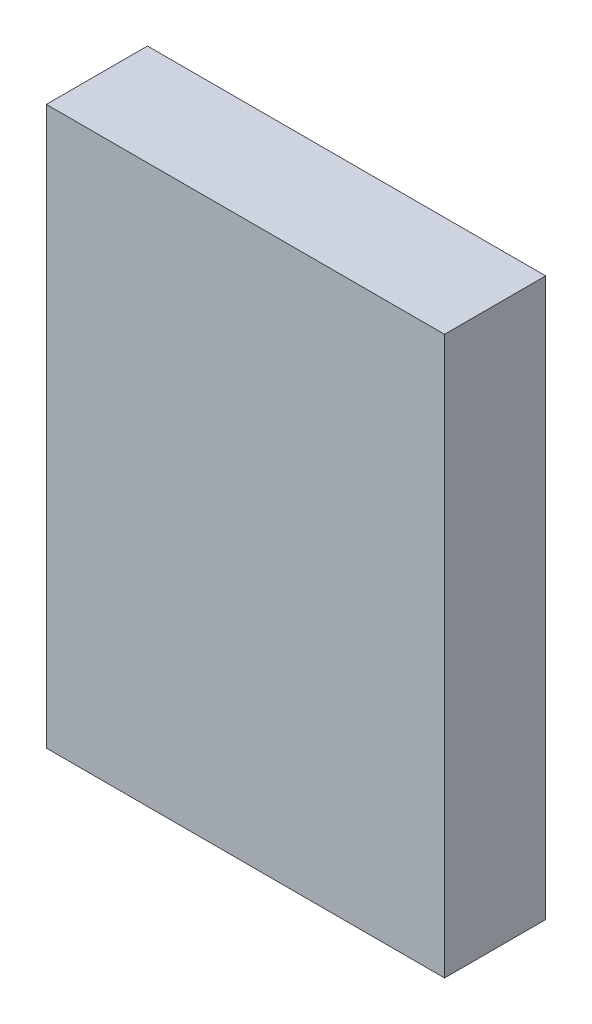
ISO-10303-21;
HEADER;
FILE_DESCRIPTION(('STEP AP214'),'2;1');
FILE_NAME('part.step','',(''),(''),'','','');
FILE_SCHEMA(('AUTOMOTIVE_DESIGN { 1 0 10303 214 1 1 1 1 }'));
ENDSEC;
DATA;
#1=APPLICATION_CONTEXT('core data for automotive mechanical design processes');
#2=APPLICATION_PROTOCOL_DEFINITION('international standard','automotive_design',2000,#1);
#3=PRODUCT_CONTEXT('',#1,'mechanical');
#4=PRODUCT('Part','Part','',(#3));
#5=PRODUCT_RELATED_PRODUCT_CATEGORY('part','',(#4));
#6=PRODUCT_DEFINITION_FORMATION('','',#4);
#7=PRODUCT_DEFINITION_CONTEXT('part definition',#1,'design');
#8=PRODUCT_DEFINITION('design','',#6,#7);
#9=PRODUCT_DEFINITION_SHAPE('','',#8);
#10=(LENGTH_UNIT() NAMED_UNIT(*) SI_UNIT(.MILLI.,.METRE.));
#11=(NAMED_UNIT(*) PLANE_ANGLE_UNIT() SI_UNIT($,.RADIAN.));
#12=(NAMED_UNIT(*) SI_UNIT($,.STERADIAN.) SOLID_ANGLE_UNIT());
#13=UNCERTAINTY_MEASURE_WITH_UNIT(LENGTH_MEASURE(1.E-05),#10,'distance_accuracy_value','');
#14=(GEOMETRIC_REPRESENTATION_CONTEXT(3) GLOBAL_UNCERTAINTY_ASSIGNED_CONTEXT((#13)) GLOBAL_UNIT_ASSIGNED_CONTEXT((#10,
#11,#12)) REPRESENTATION_CONTEXT('',''));
#15=CARTESIAN_POINT('',(0.,0.,0.));
#16=DIRECTION('',(0.,0.,1.));
#17=DIRECTION('',(1.,0.,0.));
#18=AXIS2_PLACEMENT_3D('',#15,#16,#17);
#19=CARTESIAN_POINT('',(-1.25000004,-1.74999904,0.635));
#20=DIRECTION('',(0.,0.,-1.));
#21=DIRECTION('',(-1.,0.,0.));
#22=AXIS2_PLACEMENT_3D('',#19,#20,#21);
#23=PLANE('',#22);
#24=DIRECTION('',(0.,1.,0.));
#25=VECTOR('',#24,1.);
#26=CARTESIAN_POINT('',(1.25000258,-1.75000158,0.635));
#27=LINE('',#26,#25);
#28=CARTESIAN_POINT('',(1.25000258,-1.75000158,0.635));
#29=VERTEX_POINT('',#28);
#30=CARTESIAN_POINT('',(1.25000258,1.75000031,0.635));
#31=VERTEX_POINT('',#30);
#32=EDGE_CURVE('E54',#29,#31,#27,.T.);
#33=ORIENTED_EDGE('',*,*,#32,.T.);
#34=DIRECTION('',(0.999999999999484,1.01599893403249E-06,0.));
#35=VECTOR('',#34,1.);
#36=CARTESIAN_POINT('',(1.25000258,1.75000158,0.635));
#37=LINE('',#36,#35);
#38=CARTESIAN_POINT('',(-1.25000004,1.74999904,0.635));
#39=VERTEX_POINT('',#38);
#40=EDGE_CURVE('E56',#31,#39,#37,.F.);
#41=ORIENTED_EDGE('',*,*,#40,.T.);
#42=DIRECTION('',(0.,1.,0.));
#43=VECTOR('',#42,1.);
#44=CARTESIAN_POINT('',(-1.25000004,1.74999904,0.635));
#45=LINE('',#44,#43);
#46=CARTESIAN_POINT('',(-1.25000004,-1.749999675,0.635));
#47=VERTEX_POINT('',#46);
#48=EDGE_CURVE('E19',#39,#47,#45,.F.);
#49=ORIENTED_EDGE('',*,*,#48,.T.);
#50=DIRECTION('',(-0.999999999999484,1.01599893403249E-06,0.));
#51=VECTOR('',#50,1.);
#52=CARTESIAN_POINT('',(-1.25000004,-1.74999904,0.635));
#53=LINE('',#52,#51);
#54=EDGE_CURVE('E79',#47,#29,#53,.F.);
#55=ORIENTED_EDGE('',*,*,#54,.T.);
#56=EDGE_LOOP('',(#33,#41,#49,#55));
#57=FACE_BOUND('',#56,.T.);
#58=ADVANCED_FACE('F16',(#57),#23,.F.);
#59=CARTESIAN_POINT('',(-1.25000004,1.74999904,0.));
#60=DIRECTION('',(1.,0.,0.));
#61=DIRECTION('',(0.,0.,-1.));
#62=AXIS2_PLACEMENT_3D('',#59,#60,#61);
#63=PLANE('',#62);
#64=DIRECTION('',(0.,0.,1.));
#65=VECTOR('',#64,1.);
#66=CARTESIAN_POINT('',(-1.25000004,-1.74999904,0.));
#67=LINE('',#66,#65);
#68=CARTESIAN_POINT('',(-1.25000004,-1.749999675,0.));
#69=VERTEX_POINT('',#68);
#70=EDGE_CURVE('E67',#69,#47,#67,.T.);
#71=ORIENTED_EDGE('',*,*,#70,.T.);
#72=ORIENTED_EDGE('',*,*,#48,.F.);
#73=DIRECTION('',(0.,0.,1.));
#74=VECTOR('',#73,1.);
#75=CARTESIAN_POINT('',(-1.25000004,1.74999904,0.));
#76=LINE('',#75,#74);
#77=CARTESIAN_POINT('',(-1.25000004,1.74999904,0.));
#78=VERTEX_POINT('',#77);
#79=EDGE_CURVE('E62',#39,#78,#76,.F.);
#80=ORIENTED_EDGE('',*,*,#79,.T.);
#81=DIRECTION('',(0.,1.,0.));
#82=VECTOR('',#81,1.);
#83=CARTESIAN_POINT('',(-1.25000004,-1.74999904,0.));
#84=LINE('',#83,#82);
#85=EDGE_CURVE('E82',#69,#78,#84,.T.);
#86=ORIENTED_EDGE('',*,*,#85,.F.);
#87=EDGE_LOOP('',(#71,#72,#80,#86));
#88=FACE_BOUND('',#87,.T.);
#89=ADVANCED_FACE('F64',(#88),#63,.F.);
#90=CARTESIAN_POINT('',(1.25000258,1.75000158,0.));
#91=DIRECTION('',(1.01599893403249E-06,-0.999999999999484,0.));
#92=DIRECTION('',(0.999999999999484,1.01599893403249E-06,0.));
#93=AXIS2_PLACEMENT_3D('',#90,#91,#92);
#94=PLANE('',#93);
#95=ORIENTED_EDGE('',*,*,#79,.F.);
#96=ORIENTED_EDGE('',*,*,#40,.F.);
#97=DIRECTION('',(0.,0.,1.));
#98=VECTOR('',#97,1.);
#99=CARTESIAN_POINT('',(1.25000258,1.75000158,0.));
#100=LINE('',#99,#98);
#101=CARTESIAN_POINT('',(1.25000258,1.750000945,0.));
#102=VERTEX_POINT('',#101);
#103=EDGE_CURVE('E74',#31,#102,#100,.F.);
#104=ORIENTED_EDGE('',*,*,#103,.T.);
#105=DIRECTION('',(-1.,0.,0.));
#106=VECTOR('',#105,1.);
#107=CARTESIAN_POINT('',(-1.25000004,1.74999904,0.));
#108=LINE('',#107,#106);
#109=EDGE_CURVE('E71',#78,#102,#108,.F.);
#110=ORIENTED_EDGE('',*,*,#109,.F.);
#111=EDGE_LOOP('',(#95,#96,#104,#110));
#112=FACE_BOUND('',#111,.T.);
#113=ADVANCED_FACE('F69',(#112),#94,.F.);
#114=CARTESIAN_POINT('',(1.25000258,-1.75000158,0.));
#115=DIRECTION('',(-1.,0.,0.));
#116=DIRECTION('',(0.,0.,1.));
#117=AXIS2_PLACEMENT_3D('',#114,#115,#116);
#118=PLANE('',#117);
#119=ORIENTED_EDGE('',*,*,#103,.F.);
#120=ORIENTED_EDGE('',*,*,#32,.F.);
#121=DIRECTION('',(0.,0.,1.));
#122=VECTOR('',#121,1.);
#123=CARTESIAN_POINT('',(1.25000258,-1.75000158,0.));
#124=LINE('',#123,#122);
#125=CARTESIAN_POINT('',(1.25000258,-1.75000158,0.));
#126=VERTEX_POINT('',#125);
#127=EDGE_CURVE('E34',#29,#126,#124,.F.);
#128=ORIENTED_EDGE('',*,*,#127,.T.);
#129=DIRECTION('',(0.,1.,0.));
#130=VECTOR('',#129,1.);
#131=CARTESIAN_POINT('',(1.25000258,-1.74999904,0.));
#132=LINE('',#131,#130);
#133=EDGE_CURVE('E25',#102,#126,#132,.F.);
#134=ORIENTED_EDGE('',*,*,#133,.F.);
#135=EDGE_LOOP('',(#119,#120,#128,#134));
#136=FACE_BOUND('',#135,.T.);
#137=ADVANCED_FACE('F88',(#136),#118,.F.);
#138=CARTESIAN_POINT('',(-1.25000004,-1.74999904,0.));
#139=DIRECTION('',(1.01599893403249E-06,0.999999999999484,0.));
#140=DIRECTION('',(-0.999999999999484,1.01599893403249E-06,0.));
#141=AXIS2_PLACEMENT_3D('',#138,#139,#140);
#142=PLANE('',#141);
#143=ORIENTED_EDGE('',*,*,#127,.F.);
#144=ORIENTED_EDGE('',*,*,#54,.F.);
#145=ORIENTED_EDGE('',*,*,#70,.F.);
#146=DIRECTION('',(-1.,0.,0.));
#147=VECTOR('',#146,1.);
#148=CARTESIAN_POINT('',(-1.25000004,-1.75000158,0.));
#149=LINE('',#148,#147);
#150=EDGE_CURVE('E11',#126,#69,#149,.T.);
#151=ORIENTED_EDGE('',*,*,#150,.F.);
#152=EDGE_LOOP('',(#143,#144,#145,#151));
#153=FACE_BOUND('',#152,.T.);
#154=ADVANCED_FACE('F90',(#153),#142,.F.);
#155=CARTESIAN_POINT('',(-1.25000004,-1.74999904,0.));
#156=DIRECTION('',(0.,0.,-1.));
#157=DIRECTION('',(-1.,0.,0.));
#158=AXIS2_PLACEMENT_3D('',#155,#156,#157);
#159=PLANE('',#158);
#160=ORIENTED_EDGE('',*,*,#133,.T.);
#161=ORIENTED_EDGE('',*,*,#150,.T.);
#162=ORIENTED_EDGE('',*,*,#85,.T.);
#163=ORIENTED_EDGE('',*,*,#109,.T.);
#164=EDGE_LOOP('',(#160,#161,#162,#163));
#165=FACE_BOUND('',#164,.T.);
#166=ADVANCED_FACE('F87',(#165),#159,.T.);
#167=CLOSED_SHELL('',(#58,#89,#113,#137,#154,#166));
#168=MANIFOLD_SOLID_BREP('B1',#167);
#169=ADVANCED_BREP_SHAPE_REPRESENTATION('',(#18,#168),#14);
#170=SHAPE_DEFINITION_REPRESENTATION(#9,#169);
ENDSEC;
END-ISO-10303-21;
